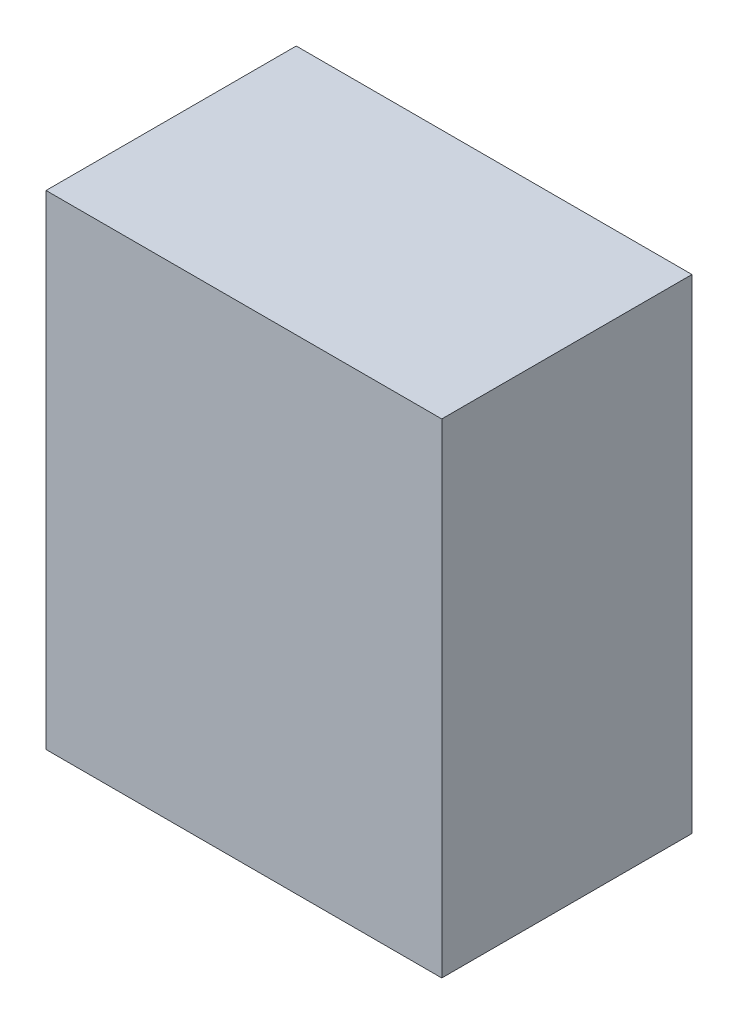
ISO-10303-21;
HEADER;
FILE_DESCRIPTION(('STEP AP214'),'2;1');
FILE_NAME('part.step','',(''),(''),'','','');
FILE_SCHEMA(('AUTOMOTIVE_DESIGN { 1 0 10303 214 1 1 1 1 }'));
ENDSEC;
DATA;
#1=APPLICATION_CONTEXT('core data for automotive mechanical design processes');
#2=APPLICATION_PROTOCOL_DEFINITION('international standard','automotive_design',2000,#1);
#3=PRODUCT_CONTEXT('',#1,'mechanical');
#4=PRODUCT('Part','Part','',(#3));
#5=PRODUCT_RELATED_PRODUCT_CATEGORY('part','',(#4));
#6=PRODUCT_DEFINITION_FORMATION('','',#4);
#7=PRODUCT_DEFINITION_CONTEXT('part definition',#1,'design');
#8=PRODUCT_DEFINITION('design','',#6,#7);
#9=PRODUCT_DEFINITION_SHAPE('','',#8);
#10=(LENGTH_UNIT() NAMED_UNIT(*) SI_UNIT(.MILLI.,.METRE.));
#11=(NAMED_UNIT(*) PLANE_ANGLE_UNIT() SI_UNIT($,.RADIAN.));
#12=(NAMED_UNIT(*) SI_UNIT($,.STERADIAN.) SOLID_ANGLE_UNIT());
#13=UNCERTAINTY_MEASURE_WITH_UNIT(LENGTH_MEASURE(1.E-05),#10,'distance_accuracy_value','');
#14=(GEOMETRIC_REPRESENTATION_CONTEXT(3) GLOBAL_UNCERTAINTY_ASSIGNED_CONTEXT((#13)) GLOBAL_UNIT_ASSIGNED_CONTEXT((#10,
#11,#12)) REPRESENTATION_CONTEXT('',''));
#15=CARTESIAN_POINT('',(0.,0.,0.));
#16=DIRECTION('',(0.,0.,1.));
#17=DIRECTION('',(1.,0.,0.));
#18=AXIS2_PLACEMENT_3D('',#15,#16,#17);
#19=CARTESIAN_POINT('',(-0.47448978,0.58050938,0.));
#20=DIRECTION('',(0.,1.,0.));
#21=DIRECTION('',(1.,0.,0.));
#22=AXIS2_PLACEMENT_3D('',#19,#20,#21);
#23=PLANE('',#22);
#24=DIRECTION('',(0.,0.,1.));
#25=VECTOR('',#24,1.);
#26=CARTESIAN_POINT('',(-0.47448978,0.58050938,0.));
#27=LINE('',#26,#25);
#28=CARTESIAN_POINT('',(-0.47448978,0.58050938,0.));
#29=VERTEX_POINT('',#28);
#30=CARTESIAN_POINT('',(-0.47448978,0.58050938,0.5999988));
#31=VERTEX_POINT('',#30);
#32=EDGE_CURVE('E11',#29,#31,#27,.T.);
#33=ORIENTED_EDGE('',*,*,#32,.T.);
#34=DIRECTION('',(1.,0.,0.));
#35=VECTOR('',#34,1.);
#36=CARTESIAN_POINT('',(-0.47448978,0.58050938,0.5999988));
#37=LINE('',#36,#35);
#38=CARTESIAN_POINT('',(0.47448978,0.58050938,0.5999988));
#39=VERTEX_POINT('',#38);
#40=EDGE_CURVE('E24',#31,#39,#37,.T.);
#41=ORIENTED_EDGE('',*,*,#40,.T.);
#42=DIRECTION('',(0.,0.,1.));
#43=VECTOR('',#42,1.);
#44=CARTESIAN_POINT('',(0.47448978,0.58050938,0.));
#45=LINE('',#44,#43);
#46=CARTESIAN_POINT('',(0.47448978,0.58050938,0.));
#47=VERTEX_POINT('',#46);
#48=EDGE_CURVE('E85',#47,#39,#45,.T.);
#49=ORIENTED_EDGE('',*,*,#48,.F.);
#50=DIRECTION('',(1.,0.,0.));
#51=VECTOR('',#50,1.);
#52=CARTESIAN_POINT('',(-0.47448978,0.58050938,0.));
#53=LINE('',#52,#51);
#54=EDGE_CURVE('E83',#29,#47,#53,.T.);
#55=ORIENTED_EDGE('',*,*,#54,.F.);
#56=EDGE_LOOP('',(#33,#41,#49,#55));
#57=FACE_BOUND('',#56,.T.);
#58=ADVANCED_FACE('F17',(#57),#23,.T.);
#59=CARTESIAN_POINT('',(0.47448978,0.58050938,0.));
#60=DIRECTION('',(1.,0.,0.));
#61=DIRECTION('',(0.,-1.,0.));
#62=AXIS2_PLACEMENT_3D('',#59,#60,#61);
#63=PLANE('',#62);
#64=ORIENTED_EDGE('',*,*,#48,.T.);
#65=DIRECTION('',(0.,-1.,0.));
#66=VECTOR('',#65,1.);
#67=CARTESIAN_POINT('',(0.47448978,0.58050938,0.5999988));
#68=LINE('',#67,#66);
#69=CARTESIAN_POINT('',(0.47448978,-0.58050938,0.5999988));
#70=VERTEX_POINT('',#69);
#71=EDGE_CURVE('E81',#39,#70,#68,.T.);
#72=ORIENTED_EDGE('',*,*,#71,.T.);
#73=DIRECTION('',(0.,0.,1.));
#74=VECTOR('',#73,1.);
#75=CARTESIAN_POINT('',(0.47448978,-0.58050938,0.));
#76=LINE('',#75,#74);
#77=CARTESIAN_POINT('',(0.47448978,-0.58050938,0.));
#78=VERTEX_POINT('',#77);
#79=EDGE_CURVE('E79',#78,#70,#76,.T.);
#80=ORIENTED_EDGE('',*,*,#79,.F.);
#81=DIRECTION('',(0.,-1.,0.));
#82=VECTOR('',#81,1.);
#83=CARTESIAN_POINT('',(0.47448978,0.58050938,0.));
#84=LINE('',#83,#82);
#85=EDGE_CURVE('E70',#47,#78,#84,.T.);
#86=ORIENTED_EDGE('',*,*,#85,.F.);
#87=EDGE_LOOP('',(#64,#72,#80,#86));
#88=FACE_BOUND('',#87,.T.);
#89=ADVANCED_FACE('F90',(#88),#63,.T.);
#90=CARTESIAN_POINT('',(0.47448978,-0.58050938,0.));
#91=DIRECTION('',(0.,-1.,0.));
#92=DIRECTION('',(-1.,0.,0.));
#93=AXIS2_PLACEMENT_3D('',#90,#91,#92);
#94=PLANE('',#93);
#95=ORIENTED_EDGE('',*,*,#79,.T.);
#96=DIRECTION('',(-1.,0.,0.));
#97=VECTOR('',#96,1.);
#98=CARTESIAN_POINT('',(0.47448978,-0.58050938,0.5999988));
#99=LINE('',#98,#97);
#100=CARTESIAN_POINT('',(-0.47448978,-0.58050938,0.5999988));
#101=VERTEX_POINT('',#100);
#102=EDGE_CURVE('E60',#70,#101,#99,.T.);
#103=ORIENTED_EDGE('',*,*,#102,.T.);
#104=DIRECTION('',(0.,0.,1.));
#105=VECTOR('',#104,1.);
#106=CARTESIAN_POINT('',(-0.47448978,-0.58050938,0.));
#107=LINE('',#106,#105);
#108=CARTESIAN_POINT('',(-0.47448978,-0.58050938,0.));
#109=VERTEX_POINT('',#108);
#110=EDGE_CURVE('E54',#109,#101,#107,.T.);
#111=ORIENTED_EDGE('',*,*,#110,.F.);
#112=DIRECTION('',(-1.,0.,0.));
#113=VECTOR('',#112,1.);
#114=CARTESIAN_POINT('',(0.47448978,-0.58050938,0.));
#115=LINE('',#114,#113);
#116=EDGE_CURVE('E58',#78,#109,#115,.T.);
#117=ORIENTED_EDGE('',*,*,#116,.F.);
#118=EDGE_LOOP('',(#95,#103,#111,#117));
#119=FACE_BOUND('',#118,.T.);
#120=ADVANCED_FACE('F57',(#119),#94,.T.);
#121=CARTESIAN_POINT('',(-0.47448978,-0.58050938,0.));
#122=DIRECTION('',(-1.,0.,0.));
#123=DIRECTION('',(0.,1.,0.));
#124=AXIS2_PLACEMENT_3D('',#121,#122,#123);
#125=PLANE('',#124);
#126=ORIENTED_EDGE('',*,*,#110,.T.);
#127=DIRECTION('',(0.,1.,0.));
#128=VECTOR('',#127,1.);
#129=CARTESIAN_POINT('',(-0.47448978,-0.58050938,0.5999988));
#130=LINE('',#129,#128);
#131=EDGE_CURVE('E71',#101,#31,#130,.T.);
#132=ORIENTED_EDGE('',*,*,#131,.T.);
#133=ORIENTED_EDGE('',*,*,#32,.F.);
#134=DIRECTION('',(0.,1.,0.));
#135=VECTOR('',#134,1.);
#136=CARTESIAN_POINT('',(-0.47448978,-0.58050938,0.));
#137=LINE('',#136,#135);
#138=EDGE_CURVE('E68',#109,#29,#137,.T.);
#139=ORIENTED_EDGE('',*,*,#138,.F.);
#140=EDGE_LOOP('',(#126,#132,#133,#139));
#141=FACE_BOUND('',#140,.T.);
#142=ADVANCED_FACE('F73',(#141),#125,.T.);
#143=CARTESIAN_POINT('',(-0.47448978,0.58050938,0.));
#144=DIRECTION('',(0.,0.,1.));
#145=DIRECTION('',(1.,0.,0.));
#146=AXIS2_PLACEMENT_3D('',#143,#144,#145);
#147=PLANE('',#146);
#148=ORIENTED_EDGE('',*,*,#54,.T.);
#149=ORIENTED_EDGE('',*,*,#85,.T.);
#150=ORIENTED_EDGE('',*,*,#116,.T.);
#151=ORIENTED_EDGE('',*,*,#138,.T.);
#152=EDGE_LOOP('',(#148,#149,#150,#151));
#153=FACE_BOUND('',#152,.T.);
#154=ADVANCED_FACE('F67',(#153),#147,.F.);
#155=CARTESIAN_POINT('',(-0.47448978,0.58050938,0.5999988));
#156=DIRECTION('',(0.,0.,1.));
#157=DIRECTION('',(1.,0.,0.));
#158=AXIS2_PLACEMENT_3D('',#155,#156,#157);
#159=PLANE('',#158);
#160=ORIENTED_EDGE('',*,*,#131,.F.);
#161=ORIENTED_EDGE('',*,*,#102,.F.);
#162=ORIENTED_EDGE('',*,*,#71,.F.);
#163=ORIENTED_EDGE('',*,*,#40,.F.);
#164=EDGE_LOOP('',(#160,#161,#162,#163));
#165=FACE_BOUND('',#164,.T.);
#166=ADVANCED_FACE('F91',(#165),#159,.T.);
#167=CLOSED_SHELL('',(#58,#89,#120,#142,#154,#166));
#168=MANIFOLD_SOLID_BREP('B1',#167);
#169=ADVANCED_BREP_SHAPE_REPRESENTATION('',(#18,#168),#14);
#170=SHAPE_DEFINITION_REPRESENTATION(#9,#169);
ENDSEC;
END-ISO-10303-21;
